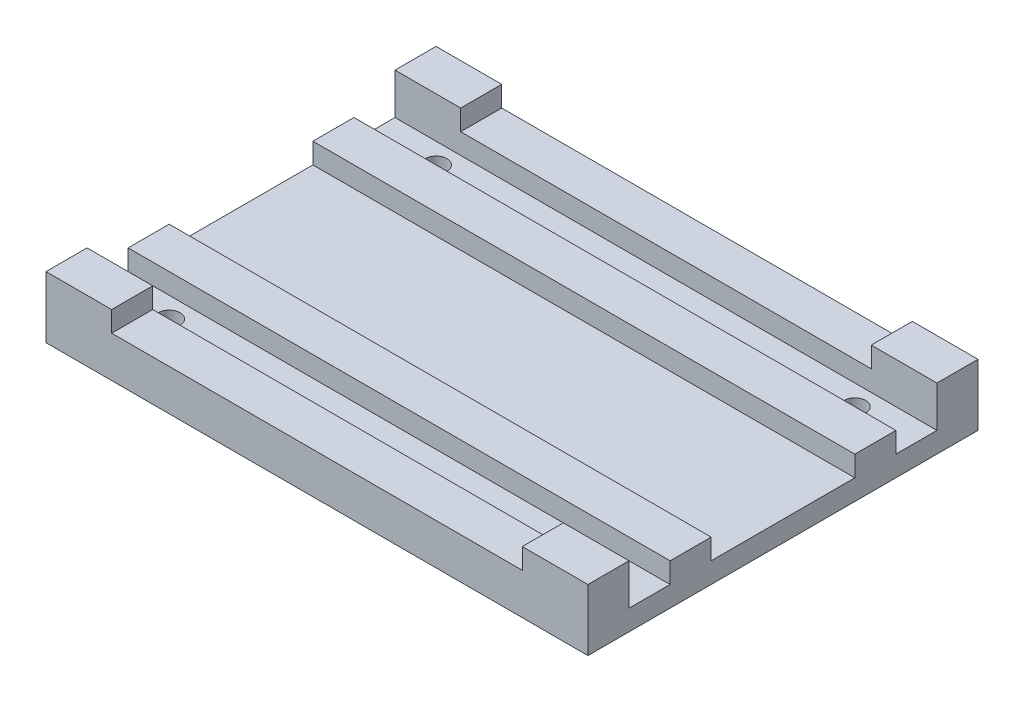
ISO-10303-21;
HEADER;
FILE_DESCRIPTION(('STEP AP214'),'2;1');
FILE_NAME('part.step','',(''),(''),'','','');
FILE_SCHEMA(('AUTOMOTIVE_DESIGN { 1 0 10303 214 1 1 1 1 }'));
ENDSEC;
DATA;
#1=APPLICATION_CONTEXT('core data for automotive mechanical design processes');
#2=APPLICATION_PROTOCOL_DEFINITION('international standard','automotive_design',2000,#1);
#3=PRODUCT_CONTEXT('',#1,'mechanical');
#4=PRODUCT('Part','Part','',(#3));
#5=PRODUCT_RELATED_PRODUCT_CATEGORY('part','',(#4));
#6=PRODUCT_DEFINITION_FORMATION('','',#4);
#7=PRODUCT_DEFINITION_CONTEXT('part definition',#1,'design');
#8=PRODUCT_DEFINITION('design','',#6,#7);
#9=PRODUCT_DEFINITION_SHAPE('','',#8);
#10=(LENGTH_UNIT() NAMED_UNIT(*) SI_UNIT(.MILLI.,.METRE.));
#11=(NAMED_UNIT(*) PLANE_ANGLE_UNIT() SI_UNIT($,.RADIAN.));
#12=(NAMED_UNIT(*) SI_UNIT($,.STERADIAN.) SOLID_ANGLE_UNIT());
#13=UNCERTAINTY_MEASURE_WITH_UNIT(LENGTH_MEASURE(1.E-05),#10,'distance_accuracy_value','');
#14=(GEOMETRIC_REPRESENTATION_CONTEXT(3) GLOBAL_UNCERTAINTY_ASSIGNED_CONTEXT((#13)) GLOBAL_UNIT_ASSIGNED_CONTEXT((#10,
#11,#12)) REPRESENTATION_CONTEXT('',''));
#15=CARTESIAN_POINT('',(0.,0.,0.));
#16=DIRECTION('',(0.,0.,1.));
#17=DIRECTION('',(1.,0.,0.));
#18=AXIS2_PLACEMENT_3D('',#15,#16,#17);
#19=CARTESIAN_POINT('',(-66.,5.,47.5));
#20=DIRECTION('',(1.,0.,0.));
#21=DIRECTION('',(0.,0.,-1.));
#22=AXIS2_PLACEMENT_3D('',#19,#20,#21);
#23=PLANE('',#22);
#24=DIRECTION('',(0.,0.,-1.));
#25=VECTOR('',#24,1.);
#26=CARTESIAN_POINT('',(-66.,10.,0.));
#27=LINE('',#26,#25);
#28=CARTESIAN_POINT('',(-66.,10.,-17.5));
#29=VERTEX_POINT('',#28);
#30=CARTESIAN_POINT('',(-66.,10.,-27.5));
#31=VERTEX_POINT('',#30);
#32=EDGE_CURVE('E408',#29,#31,#27,.T.);
#33=ORIENTED_EDGE('',*,*,#32,.T.);
#34=DIRECTION('',(0.,-1.,0.));
#35=VECTOR('',#34,1.);
#36=CARTESIAN_POINT('',(-66.,15.,-27.5));
#37=LINE('',#36,#35);
#38=CARTESIAN_POINT('',(-66.,5.,-27.5));
#39=VERTEX_POINT('',#38);
#40=EDGE_CURVE('E319',#31,#39,#37,.T.);
#41=ORIENTED_EDGE('',*,*,#40,.T.);
#42=DIRECTION('',(0.,0.,1.));
#43=VECTOR('',#42,1.);
#44=CARTESIAN_POINT('',(-66.,5.,47.5));
#45=LINE('',#44,#43);
#46=CARTESIAN_POINT('',(-66.,5.,-37.5));
#47=VERTEX_POINT('',#46);
#48=EDGE_CURVE('E262',#47,#39,#45,.T.);
#49=ORIENTED_EDGE('',*,*,#48,.F.);
#50=DIRECTION('',(0.,-1.,0.));
#51=VECTOR('',#50,1.);
#52=CARTESIAN_POINT('',(-66.,15.,-37.5));
#53=LINE('',#52,#51);
#54=CARTESIAN_POINT('',(-66.,15.,-37.5));
#55=VERTEX_POINT('',#54);
#56=EDGE_CURVE('E242',#55,#47,#53,.T.);
#57=ORIENTED_EDGE('',*,*,#56,.F.);
#58=DIRECTION('',(0.,0.,1.));
#59=VECTOR('',#58,1.);
#60=CARTESIAN_POINT('',(-66.,15.,-37.5));
#61=LINE('',#60,#59);
#62=CARTESIAN_POINT('',(-66.,15.,-47.5));
#63=VERTEX_POINT('',#62);
#64=EDGE_CURVE('E241',#63,#55,#61,.T.);
#65=ORIENTED_EDGE('',*,*,#64,.F.);
#66=DIRECTION('',(0.,-1.,0.));
#67=VECTOR('',#66,1.);
#68=CARTESIAN_POINT('',(-66.,5.,-47.5));
#69=LINE('',#68,#67);
#70=CARTESIAN_POINT('',(-66.,0.,-47.5));
#71=VERTEX_POINT('',#70);
#72=EDGE_CURVE('E287',#63,#71,#69,.T.);
#73=ORIENTED_EDGE('',*,*,#72,.T.);
#74=DIRECTION('',(0.,0.,1.));
#75=VECTOR('',#74,1.);
#76=CARTESIAN_POINT('',(-66.,0.,47.5));
#77=LINE('',#76,#75);
#78=CARTESIAN_POINT('',(-66.,0.,47.5));
#79=VERTEX_POINT('',#78);
#80=EDGE_CURVE('E346',#71,#79,#77,.T.);
#81=ORIENTED_EDGE('',*,*,#80,.T.);
#82=DIRECTION('',(0.,-1.,0.));
#83=VECTOR('',#82,1.);
#84=CARTESIAN_POINT('',(-66.,5.,47.5));
#85=LINE('',#84,#83);
#86=CARTESIAN_POINT('',(-66.,15.,47.5));
#87=VERTEX_POINT('',#86);
#88=EDGE_CURVE('E290',#87,#79,#85,.T.);
#89=ORIENTED_EDGE('',*,*,#88,.F.);
#90=DIRECTION('',(0.,0.,1.));
#91=VECTOR('',#90,1.);
#92=CARTESIAN_POINT('',(-66.,15.,37.5));
#93=LINE('',#92,#91);
#94=CARTESIAN_POINT('',(-66.,15.,37.5));
#95=VERTEX_POINT('',#94);
#96=EDGE_CURVE('E375',#95,#87,#93,.T.);
#97=ORIENTED_EDGE('',*,*,#96,.F.);
#98=DIRECTION('',(0.,-1.,0.));
#99=VECTOR('',#98,1.);
#100=CARTESIAN_POINT('',(-66.,15.,37.5));
#101=LINE('',#100,#99);
#102=CARTESIAN_POINT('',(-66.,5.,37.5));
#103=VERTEX_POINT('',#102);
#104=EDGE_CURVE('E399',#95,#103,#101,.T.);
#105=ORIENTED_EDGE('',*,*,#104,.T.);
#106=CARTESIAN_POINT('',(-66.,5.,27.5));
#107=VERTEX_POINT('',#106);
#108=EDGE_CURVE('E282',#107,#103,#45,.T.);
#109=ORIENTED_EDGE('',*,*,#108,.F.);
#110=DIRECTION('',(0.,-1.,0.));
#111=VECTOR('',#110,1.);
#112=CARTESIAN_POINT('',(-66.,15.,27.5));
#113=LINE('',#112,#111);
#114=CARTESIAN_POINT('',(-66.,10.,27.5));
#115=VERTEX_POINT('',#114);
#116=EDGE_CURVE('E403',#115,#107,#113,.T.);
#117=ORIENTED_EDGE('',*,*,#116,.F.);
#118=DIRECTION('',(0.,0.,-1.));
#119=VECTOR('',#118,1.);
#120=CARTESIAN_POINT('',(-66.,10.,0.));
#121=LINE('',#120,#119);
#122=CARTESIAN_POINT('',(-66.,10.,17.5));
#123=VERTEX_POINT('',#122);
#124=EDGE_CURVE('E204',#115,#123,#121,.T.);
#125=ORIENTED_EDGE('',*,*,#124,.T.);
#126=DIRECTION('',(0.,-1.,0.));
#127=VECTOR('',#126,1.);
#128=CARTESIAN_POINT('',(-66.,15.,17.5));
#129=LINE('',#128,#127);
#130=CARTESIAN_POINT('',(-66.,5.,17.5));
#131=VERTEX_POINT('',#130);
#132=EDGE_CURVE('E227',#123,#131,#129,.T.);
#133=ORIENTED_EDGE('',*,*,#132,.T.);
#134=CARTESIAN_POINT('',(-66.,5.,-17.5));
#135=VERTEX_POINT('',#134);
#136=EDGE_CURVE('E267',#135,#131,#45,.T.);
#137=ORIENTED_EDGE('',*,*,#136,.F.);
#138=DIRECTION('',(0.,-1.,0.));
#139=VECTOR('',#138,1.);
#140=CARTESIAN_POINT('',(-66.,15.,-17.5));
#141=LINE('',#140,#139);
#142=EDGE_CURVE('E295',#29,#135,#141,.T.);
#143=ORIENTED_EDGE('',*,*,#142,.F.);
#144=EDGE_LOOP('',(#33,#41,#49,#57,#65,#73,#81,#89,#97,#105,#109,#117,#125,#133,#137,#143));
#145=FACE_BOUND('',#144,.T.);
#146=ADVANCED_FACE('F34',(#145),#23,.F.);
#147=CARTESIAN_POINT('',(-66.,5.,47.5));
#148=DIRECTION('',(0.,0.,-1.));
#149=DIRECTION('',(-1.,0.,0.));
#150=AXIS2_PLACEMENT_3D('',#147,#148,#149);
#151=PLANE('',#150);
#152=DIRECTION('',(0.,-1.,0.));
#153=VECTOR('',#152,1.);
#154=CARTESIAN_POINT('',(-50.,5.,47.5));
#155=LINE('',#154,#153);
#156=CARTESIAN_POINT('',(-50.,15.,47.5));
#157=VERTEX_POINT('',#156);
#158=CARTESIAN_POINT('',(-50.,10.,47.5));
#159=VERTEX_POINT('',#158);
#160=EDGE_CURVE('E427',#157,#159,#155,.T.);
#161=ORIENTED_EDGE('',*,*,#160,.F.);
#162=DIRECTION('',(1.,0.,0.));
#163=VECTOR('',#162,1.);
#164=CARTESIAN_POINT('',(-66.,15.,47.5));
#165=LINE('',#164,#163);
#166=EDGE_CURVE('E371',#87,#157,#165,.T.);
#167=ORIENTED_EDGE('',*,*,#166,.F.);
#168=ORIENTED_EDGE('',*,*,#88,.T.);
#169=DIRECTION('',(1.,0.,0.));
#170=VECTOR('',#169,1.);
#171=CARTESIAN_POINT('',(-66.,0.,47.5));
#172=LINE('',#171,#170);
#173=CARTESIAN_POINT('',(66.,0.,47.5));
#174=VERTEX_POINT('',#173);
#175=EDGE_CURVE('E350',#79,#174,#172,.T.);
#176=ORIENTED_EDGE('',*,*,#175,.T.);
#177=DIRECTION('',(0.,-1.,0.));
#178=VECTOR('',#177,1.);
#179=CARTESIAN_POINT('',(66.,5.,47.5));
#180=LINE('',#179,#178);
#181=CARTESIAN_POINT('',(66.,15.,47.5));
#182=VERTEX_POINT('',#181);
#183=EDGE_CURVE('E362',#182,#174,#180,.T.);
#184=ORIENTED_EDGE('',*,*,#183,.F.);
#185=CARTESIAN_POINT('',(50.,15.,47.5));
#186=VERTEX_POINT('',#185);
#187=EDGE_CURVE('E382',#186,#182,#165,.T.);
#188=ORIENTED_EDGE('',*,*,#187,.F.);
#189=DIRECTION('',(0.,-1.,0.));
#190=VECTOR('',#189,1.);
#191=CARTESIAN_POINT('',(50.,5.,47.5));
#192=LINE('',#191,#190);
#193=CARTESIAN_POINT('',(50.,10.,47.5));
#194=VERTEX_POINT('',#193);
#195=EDGE_CURVE('E59',#186,#194,#192,.T.);
#196=ORIENTED_EDGE('',*,*,#195,.T.);
#197=DIRECTION('',(1.,0.,0.));
#198=VECTOR('',#197,1.);
#199=CARTESIAN_POINT('',(-66.,10.,47.5));
#200=LINE('',#199,#198);
#201=EDGE_CURVE('E433',#159,#194,#200,.T.);
#202=ORIENTED_EDGE('',*,*,#201,.F.);
#203=EDGE_LOOP('',(#161,#167,#168,#176,#184,#188,#196,#202));
#204=FACE_BOUND('',#203,.T.);
#205=ADVANCED_FACE('F368',(#204),#151,.F.);
#206=CARTESIAN_POINT('',(66.,5.,47.5));
#207=DIRECTION('',(-1.,0.,0.));
#208=DIRECTION('',(0.,0.,1.));
#209=AXIS2_PLACEMENT_3D('',#206,#207,#208);
#210=PLANE('',#209);
#211=DIRECTION('',(0.,0.,-1.));
#212=VECTOR('',#211,1.);
#213=CARTESIAN_POINT('',(66.,10.,0.));
#214=LINE('',#213,#212);
#215=CARTESIAN_POINT('',(66.,10.,27.5));
#216=VERTEX_POINT('',#215);
#217=CARTESIAN_POINT('',(66.,10.,17.5));
#218=VERTEX_POINT('',#217);
#219=EDGE_CURVE('E201',#216,#218,#214,.T.);
#220=ORIENTED_EDGE('',*,*,#219,.F.);
#221=DIRECTION('',(0.,-1.,0.));
#222=VECTOR('',#221,1.);
#223=CARTESIAN_POINT('',(66.,15.,27.5));
#224=LINE('',#223,#222);
#225=CARTESIAN_POINT('',(66.,5.,27.5));
#226=VERTEX_POINT('',#225);
#227=EDGE_CURVE('E212',#216,#226,#224,.T.);
#228=ORIENTED_EDGE('',*,*,#227,.T.);
#229=DIRECTION('',(0.,0.,-1.));
#230=VECTOR('',#229,1.);
#231=CARTESIAN_POINT('',(66.,5.,47.5));
#232=LINE('',#231,#230);
#233=CARTESIAN_POINT('',(66.,5.,37.5));
#234=VERTEX_POINT('',#233);
#235=EDGE_CURVE('E285',#234,#226,#232,.T.);
#236=ORIENTED_EDGE('',*,*,#235,.F.);
#237=DIRECTION('',(0.,-1.,0.));
#238=VECTOR('',#237,1.);
#239=CARTESIAN_POINT('',(66.,15.,37.5));
#240=LINE('',#239,#238);
#241=CARTESIAN_POINT('',(66.,15.,37.5));
#242=VERTEX_POINT('',#241);
#243=EDGE_CURVE('E392',#242,#234,#240,.T.);
#244=ORIENTED_EDGE('',*,*,#243,.F.);
#245=DIRECTION('',(0.,0.,-1.));
#246=VECTOR('',#245,1.);
#247=CARTESIAN_POINT('',(66.,15.,37.5));
#248=LINE('',#247,#246);
#249=EDGE_CURVE('E390',#182,#242,#248,.T.);
#250=ORIENTED_EDGE('',*,*,#249,.F.);
#251=ORIENTED_EDGE('',*,*,#183,.T.);
#252=DIRECTION('',(0.,0.,-1.));
#253=VECTOR('',#252,1.);
#254=CARTESIAN_POINT('',(66.,0.,47.5));
#255=LINE('',#254,#253);
#256=CARTESIAN_POINT('',(66.,0.,-47.5));
#257=VERTEX_POINT('',#256);
#258=EDGE_CURVE('E353',#174,#257,#255,.T.);
#259=ORIENTED_EDGE('',*,*,#258,.T.);
#260=DIRECTION('',(0.,-1.,0.));
#261=VECTOR('',#260,1.);
#262=CARTESIAN_POINT('',(66.,5.,-47.5));
#263=LINE('',#262,#261);
#264=CARTESIAN_POINT('',(66.,15.,-47.5));
#265=VERTEX_POINT('',#264);
#266=EDGE_CURVE('E359',#265,#257,#263,.T.);
#267=ORIENTED_EDGE('',*,*,#266,.F.);
#268=DIRECTION('',(0.,0.,-1.));
#269=VECTOR('',#268,1.);
#270=CARTESIAN_POINT('',(66.,15.,-37.5));
#271=LINE('',#270,#269);
#272=CARTESIAN_POINT('',(66.,15.,-37.5));
#273=VERTEX_POINT('',#272);
#274=EDGE_CURVE('E234',#273,#265,#271,.T.);
#275=ORIENTED_EDGE('',*,*,#274,.F.);
#276=DIRECTION('',(0.,-1.,0.));
#277=VECTOR('',#276,1.);
#278=CARTESIAN_POINT('',(66.,15.,-37.5));
#279=LINE('',#278,#277);
#280=CARTESIAN_POINT('',(66.,5.,-37.5));
#281=VERTEX_POINT('',#280);
#282=EDGE_CURVE('E246',#273,#281,#279,.T.);
#283=ORIENTED_EDGE('',*,*,#282,.T.);
#284=CARTESIAN_POINT('',(66.,5.,-27.5));
#285=VERTEX_POINT('',#284);
#286=EDGE_CURVE('E266',#285,#281,#232,.T.);
#287=ORIENTED_EDGE('',*,*,#286,.F.);
#288=DIRECTION('',(0.,-1.,0.));
#289=VECTOR('',#288,1.);
#290=CARTESIAN_POINT('',(66.,15.,-27.5));
#291=LINE('',#290,#289);
#292=CARTESIAN_POINT('',(66.,10.,-27.5));
#293=VERTEX_POINT('',#292);
#294=EDGE_CURVE('E37',#293,#285,#291,.T.);
#295=ORIENTED_EDGE('',*,*,#294,.F.);
#296=DIRECTION('',(0.,0.,-1.));
#297=VECTOR('',#296,1.);
#298=CARTESIAN_POINT('',(66.,10.,0.));
#299=LINE('',#298,#297);
#300=CARTESIAN_POINT('',(66.,10.,-17.5));
#301=VERTEX_POINT('',#300);
#302=EDGE_CURVE('E466',#301,#293,#299,.T.);
#303=ORIENTED_EDGE('',*,*,#302,.F.);
#304=DIRECTION('',(0.,-1.,0.));
#305=VECTOR('',#304,1.);
#306=CARTESIAN_POINT('',(66.,15.,-17.5));
#307=LINE('',#306,#305);
#308=CARTESIAN_POINT('',(66.,5.,-17.5));
#309=VERTEX_POINT('',#308);
#310=EDGE_CURVE('E292',#301,#309,#307,.T.);
#311=ORIENTED_EDGE('',*,*,#310,.T.);
#312=CARTESIAN_POINT('',(66.,5.,17.5));
#313=VERTEX_POINT('',#312);
#314=EDGE_CURVE('E268',#313,#309,#232,.T.);
#315=ORIENTED_EDGE('',*,*,#314,.F.);
#316=DIRECTION('',(0.,-1.,0.));
#317=VECTOR('',#316,1.);
#318=CARTESIAN_POINT('',(66.,15.,17.5));
#319=LINE('',#318,#317);
#320=EDGE_CURVE('E215',#218,#313,#319,.T.);
#321=ORIENTED_EDGE('',*,*,#320,.F.);
#322=EDGE_LOOP('',(#220,#228,#236,#244,#250,#251,#259,#267,#275,#283,#287,#295,#303,#311,#315,#321));
#323=FACE_BOUND('',#322,.T.);
#324=ADVANCED_FACE('F211',(#323),#210,.F.);
#325=CARTESIAN_POINT('',(-66.,5.,-47.5));
#326=DIRECTION('',(0.,0.,1.));
#327=DIRECTION('',(1.,0.,0.));
#328=AXIS2_PLACEMENT_3D('',#325,#326,#327);
#329=PLANE('',#328);
#330=DIRECTION('',(0.,1.,0.));
#331=VECTOR('',#330,1.);
#332=CARTESIAN_POINT('',(-50.,5.,-47.5));
#333=LINE('',#332,#331);
#334=CARTESIAN_POINT('',(-50.,10.,-47.5));
#335=VERTEX_POINT('',#334);
#336=CARTESIAN_POINT('',(-50.,15.,-47.5));
#337=VERTEX_POINT('',#336);
#338=EDGE_CURVE('E396',#335,#337,#333,.T.);
#339=ORIENTED_EDGE('',*,*,#338,.F.);
#340=DIRECTION('',(-1.,0.,0.));
#341=VECTOR('',#340,1.);
#342=CARTESIAN_POINT('',(-66.,10.,-47.5));
#343=LINE('',#342,#341);
#344=CARTESIAN_POINT('',(50.,10.,-47.5));
#345=VERTEX_POINT('',#344);
#346=EDGE_CURVE('E431',#345,#335,#343,.T.);
#347=ORIENTED_EDGE('',*,*,#346,.F.);
#348=DIRECTION('',(0.,1.,0.));
#349=VECTOR('',#348,1.);
#350=CARTESIAN_POINT('',(50.,5.,-47.5));
#351=LINE('',#350,#349);
#352=CARTESIAN_POINT('',(50.,15.,-47.5));
#353=VERTEX_POINT('',#352);
#354=EDGE_CURVE('E436',#345,#353,#351,.T.);
#355=ORIENTED_EDGE('',*,*,#354,.T.);
#356=DIRECTION('',(-1.,0.,0.));
#357=VECTOR('',#356,1.);
#358=CARTESIAN_POINT('',(-66.,15.,-47.5));
#359=LINE('',#358,#357);
#360=EDGE_CURVE('E238',#265,#353,#359,.T.);
#361=ORIENTED_EDGE('',*,*,#360,.F.);
#362=ORIENTED_EDGE('',*,*,#266,.T.);
#363=DIRECTION('',(-1.,0.,0.));
#364=VECTOR('',#363,1.);
#365=CARTESIAN_POINT('',(-66.,0.,-47.5));
#366=LINE('',#365,#364);
#367=EDGE_CURVE('E284',#257,#71,#366,.T.);
#368=ORIENTED_EDGE('',*,*,#367,.T.);
#369=ORIENTED_EDGE('',*,*,#72,.F.);
#370=EDGE_CURVE('E237',#337,#63,#359,.T.);
#371=ORIENTED_EDGE('',*,*,#370,.F.);
#372=EDGE_LOOP('',(#339,#347,#355,#361,#362,#368,#369,#371));
#373=FACE_BOUND('',#372,.T.);
#374=ADVANCED_FACE('F454',(#373),#329,.F.);
#375=CARTESIAN_POINT('',(-66.,15.,-27.5));
#376=DIRECTION('',(0.,0.,1.));
#377=DIRECTION('',(1.,0.,0.));
#378=AXIS2_PLACEMENT_3D('',#375,#376,#377);
#379=PLANE('',#378);
#380=DIRECTION('',(1.,0.,0.));
#381=VECTOR('',#380,1.);
#382=CARTESIAN_POINT('',(0.,10.,-27.5));
#383=LINE('',#382,#381);
#384=EDGE_CURVE('E412',#31,#293,#383,.T.);
#385=ORIENTED_EDGE('',*,*,#384,.T.);
#386=ORIENTED_EDGE('',*,*,#294,.T.);
#387=DIRECTION('',(-1.,0.,0.));
#388=VECTOR('',#387,1.);
#389=CARTESIAN_POINT('',(-66.,5.,-27.5));
#390=LINE('',#389,#388);
#391=EDGE_CURVE('E249',#285,#39,#390,.T.);
#392=ORIENTED_EDGE('',*,*,#391,.T.);
#393=ORIENTED_EDGE('',*,*,#40,.F.);
#394=EDGE_LOOP('',(#385,#386,#392,#393));
#395=FACE_BOUND('',#394,.T.);
#396=ADVANCED_FACE('F483',(#395),#379,.F.);
#397=CARTESIAN_POINT('',(-66.,15.,-17.5));
#398=DIRECTION('',(0.,0.,-1.));
#399=DIRECTION('',(-1.,0.,0.));
#400=AXIS2_PLACEMENT_3D('',#397,#398,#399);
#401=PLANE('',#400);
#402=DIRECTION('',(-1.,0.,0.));
#403=VECTOR('',#402,1.);
#404=CARTESIAN_POINT('',(0.,10.,-17.5));
#405=LINE('',#404,#403);
#406=EDGE_CURVE('E216',#301,#29,#405,.T.);
#407=ORIENTED_EDGE('',*,*,#406,.T.);
#408=ORIENTED_EDGE('',*,*,#142,.T.);
#409=DIRECTION('',(1.,0.,0.));
#410=VECTOR('',#409,1.);
#411=CARTESIAN_POINT('',(-66.,5.,-17.5));
#412=LINE('',#411,#410);
#413=EDGE_CURVE('E257',#135,#309,#412,.T.);
#414=ORIENTED_EDGE('',*,*,#413,.T.);
#415=ORIENTED_EDGE('',*,*,#310,.F.);
#416=EDGE_LOOP('',(#407,#408,#414,#415));
#417=FACE_BOUND('',#416,.T.);
#418=ADVANCED_FACE('F314',(#417),#401,.F.);
#419=CARTESIAN_POINT('',(-66.,15.,-37.5));
#420=DIRECTION('',(0.,0.,-1.));
#421=DIRECTION('',(-1.,0.,0.));
#422=AXIS2_PLACEMENT_3D('',#419,#420,#421);
#423=PLANE('',#422);
#424=DIRECTION('',(0.,-1.,0.));
#425=VECTOR('',#424,1.);
#426=CARTESIAN_POINT('',(-50.,15.,-37.5));
#427=LINE('',#426,#425);
#428=CARTESIAN_POINT('',(-50.,15.,-37.5));
#429=VERTEX_POINT('',#428);
#430=CARTESIAN_POINT('',(-50.,10.,-37.5));
#431=VERTEX_POINT('',#430);
#432=EDGE_CURVE('E439',#429,#431,#427,.T.);
#433=ORIENTED_EDGE('',*,*,#432,.F.);
#434=DIRECTION('',(1.,0.,0.));
#435=VECTOR('',#434,1.);
#436=CARTESIAN_POINT('',(-66.,15.,-37.5));
#437=LINE('',#436,#435);
#438=EDGE_CURVE('E231',#55,#429,#437,.T.);
#439=ORIENTED_EDGE('',*,*,#438,.F.);
#440=ORIENTED_EDGE('',*,*,#56,.T.);
#441=DIRECTION('',(1.,0.,0.));
#442=VECTOR('',#441,1.);
#443=CARTESIAN_POINT('',(-66.,5.,-37.5));
#444=LINE('',#443,#442);
#445=EDGE_CURVE('E222',#47,#281,#444,.T.);
#446=ORIENTED_EDGE('',*,*,#445,.T.);
#447=ORIENTED_EDGE('',*,*,#282,.F.);
#448=CARTESIAN_POINT('',(50.,15.,-37.5));
#449=VERTEX_POINT('',#448);
#450=EDGE_CURVE('E225',#449,#273,#437,.T.);
#451=ORIENTED_EDGE('',*,*,#450,.F.);
#452=DIRECTION('',(0.,-1.,0.));
#453=VECTOR('',#452,1.);
#454=CARTESIAN_POINT('',(50.,15.,-37.5));
#455=LINE('',#454,#453);
#456=CARTESIAN_POINT('',(50.,10.,-37.5));
#457=VERTEX_POINT('',#456);
#458=EDGE_CURVE('E51',#449,#457,#455,.T.);
#459=ORIENTED_EDGE('',*,*,#458,.T.);
#460=DIRECTION('',(1.,0.,0.));
#461=VECTOR('',#460,1.);
#462=CARTESIAN_POINT('',(-66.,10.,-37.5));
#463=LINE('',#462,#461);
#464=EDGE_CURVE('E429',#431,#457,#463,.T.);
#465=ORIENTED_EDGE('',*,*,#464,.F.);
#466=EDGE_LOOP('',(#433,#439,#440,#446,#447,#451,#459,#465));
#467=FACE_BOUND('',#466,.T.);
#468=ADVANCED_FACE('F459',(#467),#423,.F.);
#469=CARTESIAN_POINT('',(0.,15.,0.));
#470=DIRECTION('',(0.,1.,0.));
#471=DIRECTION('',(0.,0.,1.));
#472=AXIS2_PLACEMENT_3D('',#469,#470,#471);
#473=PLANE('',#472);
#474=ORIENTED_EDGE('',*,*,#438,.T.);
#475=DIRECTION('',(0.,0.,-1.));
#476=VECTOR('',#475,1.);
#477=CARTESIAN_POINT('',(-50.,15.,0.));
#478=LINE('',#477,#476);
#479=EDGE_CURVE('E416',#429,#337,#478,.T.);
#480=ORIENTED_EDGE('',*,*,#479,.T.);
#481=ORIENTED_EDGE('',*,*,#370,.T.);
#482=ORIENTED_EDGE('',*,*,#64,.T.);
#483=EDGE_LOOP('',(#474,#480,#481,#482));
#484=FACE_BOUND('',#483,.T.);
#485=ADVANCED_FACE('F451',(#484),#473,.T.);
#486=CARTESIAN_POINT('',(-66.,15.,27.5));
#487=DIRECTION('',(0.,0.,-1.));
#488=DIRECTION('',(-1.,0.,0.));
#489=AXIS2_PLACEMENT_3D('',#486,#487,#488);
#490=PLANE('',#489);
#491=DIRECTION('',(-1.,0.,0.));
#492=VECTOR('',#491,1.);
#493=CARTESIAN_POINT('',(0.,10.,27.5));
#494=LINE('',#493,#492);
#495=EDGE_CURVE('E198',#216,#115,#494,.T.);
#496=ORIENTED_EDGE('',*,*,#495,.T.);
#497=ORIENTED_EDGE('',*,*,#116,.T.);
#498=DIRECTION('',(1.,0.,0.));
#499=VECTOR('',#498,1.);
#500=CARTESIAN_POINT('',(-66.,5.,27.5));
#501=LINE('',#500,#499);
#502=EDGE_CURVE('E221',#107,#226,#501,.T.);
#503=ORIENTED_EDGE('',*,*,#502,.T.);
#504=ORIENTED_EDGE('',*,*,#227,.F.);
#505=EDGE_LOOP('',(#496,#497,#503,#504));
#506=FACE_BOUND('',#505,.T.);
#507=ADVANCED_FACE('F219',(#506),#490,.F.);
#508=CARTESIAN_POINT('',(-66.,15.,17.5));
#509=DIRECTION('',(0.,0.,1.));
#510=DIRECTION('',(1.,0.,0.));
#511=AXIS2_PLACEMENT_3D('',#508,#509,#510);
#512=PLANE('',#511);
#513=DIRECTION('',(1.,0.,0.));
#514=VECTOR('',#513,1.);
#515=CARTESIAN_POINT('',(0.,10.,17.5));
#516=LINE('',#515,#514);
#517=EDGE_CURVE('E407',#123,#218,#516,.T.);
#518=ORIENTED_EDGE('',*,*,#517,.T.);
#519=ORIENTED_EDGE('',*,*,#320,.T.);
#520=DIRECTION('',(-1.,0.,0.));
#521=VECTOR('',#520,1.);
#522=CARTESIAN_POINT('',(-66.,5.,17.5));
#523=LINE('',#522,#521);
#524=EDGE_CURVE('E311',#313,#131,#523,.T.);
#525=ORIENTED_EDGE('',*,*,#524,.T.);
#526=ORIENTED_EDGE('',*,*,#132,.F.);
#527=EDGE_LOOP('',(#518,#519,#525,#526));
#528=FACE_BOUND('',#527,.T.);
#529=ADVANCED_FACE('F406',(#528),#512,.F.);
#530=CARTESIAN_POINT('',(-66.,15.,37.5));
#531=DIRECTION('',(0.,0.,1.));
#532=DIRECTION('',(1.,0.,0.));
#533=AXIS2_PLACEMENT_3D('',#530,#531,#532);
#534=PLANE('',#533);
#535=DIRECTION('',(0.,1.,0.));
#536=VECTOR('',#535,1.);
#537=CARTESIAN_POINT('',(-50.,15.,37.5));
#538=LINE('',#537,#536);
#539=CARTESIAN_POINT('',(-50.,10.,37.5));
#540=VERTEX_POINT('',#539);
#541=CARTESIAN_POINT('',(-50.,15.,37.5));
#542=VERTEX_POINT('',#541);
#543=EDGE_CURVE('E425',#540,#542,#538,.T.);
#544=ORIENTED_EDGE('',*,*,#543,.F.);
#545=DIRECTION('',(-1.,0.,0.));
#546=VECTOR('',#545,1.);
#547=CARTESIAN_POINT('',(-66.,10.,37.5));
#548=LINE('',#547,#546);
#549=CARTESIAN_POINT('',(50.,10.,37.5));
#550=VERTEX_POINT('',#549);
#551=EDGE_CURVE('E11',#550,#540,#548,.T.);
#552=ORIENTED_EDGE('',*,*,#551,.F.);
#553=DIRECTION('',(0.,1.,0.));
#554=VECTOR('',#553,1.);
#555=CARTESIAN_POINT('',(50.,15.,37.5));
#556=LINE('',#555,#554);
#557=CARTESIAN_POINT('',(50.,15.,37.5));
#558=VERTEX_POINT('',#557);
#559=EDGE_CURVE('E410',#550,#558,#556,.T.);
#560=ORIENTED_EDGE('',*,*,#559,.T.);
#561=DIRECTION('',(-1.,0.,0.));
#562=VECTOR('',#561,1.);
#563=CARTESIAN_POINT('',(-66.,15.,37.5));
#564=LINE('',#563,#562);
#565=EDGE_CURVE('E383',#242,#558,#564,.T.);
#566=ORIENTED_EDGE('',*,*,#565,.F.);
#567=ORIENTED_EDGE('',*,*,#243,.T.);
#568=DIRECTION('',(-1.,0.,0.));
#569=VECTOR('',#568,1.);
#570=CARTESIAN_POINT('',(-66.,5.,37.5));
#571=LINE('',#570,#569);
#572=EDGE_CURVE('E393',#234,#103,#571,.T.);
#573=ORIENTED_EDGE('',*,*,#572,.T.);
#574=ORIENTED_EDGE('',*,*,#104,.F.);
#575=EDGE_CURVE('E381',#542,#95,#564,.T.);
#576=ORIENTED_EDGE('',*,*,#575,.F.);
#577=EDGE_LOOP('',(#544,#552,#560,#566,#567,#573,#574,#576));
#578=FACE_BOUND('',#577,.T.);
#579=ADVANCED_FACE('F553',(#578),#534,.F.);
#580=CARTESIAN_POINT('',(0.,15.,0.));
#581=DIRECTION('',(0.,-1.,0.));
#582=DIRECTION('',(0.,0.,-1.));
#583=AXIS2_PLACEMENT_3D('',#580,#581,#582);
#584=PLANE('',#583);
#585=DIRECTION('',(0.,0.,1.));
#586=VECTOR('',#585,1.);
#587=CARTESIAN_POINT('',(-50.,15.,0.));
#588=LINE('',#587,#586);
#589=EDGE_CURVE('E43',#542,#157,#588,.T.);
#590=ORIENTED_EDGE('',*,*,#589,.F.);
#591=ORIENTED_EDGE('',*,*,#575,.T.);
#592=ORIENTED_EDGE('',*,*,#96,.T.);
#593=ORIENTED_EDGE('',*,*,#166,.T.);
#594=EDGE_LOOP('',(#590,#591,#592,#593));
#595=FACE_BOUND('',#594,.T.);
#596=ADVANCED_FACE('F379',(#595),#584,.F.);
#597=CARTESIAN_POINT('',(0.,5.,0.));
#598=DIRECTION('',(0.,-1.,0.));
#599=DIRECTION('',(0.,0.,-1.));
#600=AXIS2_PLACEMENT_3D('',#597,#598,#599);
#601=PLANE('',#600);
#602=CARTESIAN_POINT('',(-51.,5.,32.5));
#603=DIRECTION('',(0.,1.,0.));
#604=DIRECTION('',(0.,0.,1.));
#605=AXIS2_PLACEMENT_3D('',#602,#603,#604);
#606=CIRCLE('',#605,2.65);
#607=CARTESIAN_POINT('',(-51.,5.,35.15));
#608=VERTEX_POINT('',#607);
#609=EDGE_CURVE('E341',#608,#608,#606,.T.);
#610=ORIENTED_EDGE('',*,*,#609,.F.);
#611=EDGE_LOOP('',(#610));
#612=FACE_BOUND('',#611,.T.);
#613=CARTESIAN_POINT('',(51.,5.,32.5));
#614=DIRECTION('',(0.,1.,0.));
#615=DIRECTION('',(0.,0.,1.));
#616=AXIS2_PLACEMENT_3D('',#613,#614,#615);
#617=CIRCLE('',#616,2.65);
#618=CARTESIAN_POINT('',(51.,5.,35.15));
#619=VERTEX_POINT('',#618);
#620=EDGE_CURVE('E336',#619,#619,#617,.T.);
#621=ORIENTED_EDGE('',*,*,#620,.F.);
#622=EDGE_LOOP('',(#621));
#623=FACE_BOUND('',#622,.T.);
#624=ORIENTED_EDGE('',*,*,#572,.F.);
#625=ORIENTED_EDGE('',*,*,#235,.T.);
#626=ORIENTED_EDGE('',*,*,#502,.F.);
#627=ORIENTED_EDGE('',*,*,#108,.T.);
#628=EDGE_LOOP('',(#624,#625,#626,#627));
#629=FACE_BOUND('',#628,.T.);
#630=ADVANCED_FACE('F525',(#612,#623,#629),#601,.F.);
#631=ORIENTED_EDGE('',*,*,#524,.F.);
#632=ORIENTED_EDGE('',*,*,#314,.T.);
#633=ORIENTED_EDGE('',*,*,#413,.F.);
#634=ORIENTED_EDGE('',*,*,#136,.T.);
#635=EDGE_LOOP('',(#631,#632,#633,#634));
#636=FACE_BOUND('',#635,.T.);
#637=ADVANCED_FACE('F307',(#636),#601,.F.);
#638=CARTESIAN_POINT('',(-51.,5.,-32.5));
#639=DIRECTION('',(0.,1.,0.));
#640=DIRECTION('',(0.,0.,1.));
#641=AXIS2_PLACEMENT_3D('',#638,#639,#640);
#642=CIRCLE('',#641,2.65);
#643=CARTESIAN_POINT('',(-51.,5.,-29.85));
#644=VERTEX_POINT('',#643);
#645=EDGE_CURVE('E320',#644,#644,#642,.T.);
#646=ORIENTED_EDGE('',*,*,#645,.F.);
#647=EDGE_LOOP('',(#646));
#648=FACE_BOUND('',#647,.T.);
#649=CARTESIAN_POINT('',(51.,5.,-32.5));
#650=DIRECTION('',(0.,1.,0.));
#651=DIRECTION('',(0.,0.,1.));
#652=AXIS2_PLACEMENT_3D('',#649,#650,#651);
#653=CIRCLE('',#652,2.65);
#654=CARTESIAN_POINT('',(51.,5.,-29.85));
#655=VERTEX_POINT('',#654);
#656=EDGE_CURVE('E328',#655,#655,#653,.T.);
#657=ORIENTED_EDGE('',*,*,#656,.F.);
#658=EDGE_LOOP('',(#657));
#659=FACE_BOUND('',#658,.T.);
#660=ORIENTED_EDGE('',*,*,#445,.F.);
#661=ORIENTED_EDGE('',*,*,#48,.T.);
#662=ORIENTED_EDGE('',*,*,#391,.F.);
#663=ORIENTED_EDGE('',*,*,#286,.T.);
#664=EDGE_LOOP('',(#660,#661,#662,#663));
#665=FACE_BOUND('',#664,.T.);
#666=ADVANCED_FACE('F484',(#648,#659,#665),#601,.F.);
#667=CARTESIAN_POINT('',(0.,0.,0.));
#668=DIRECTION('',(0.,-1.,0.));
#669=DIRECTION('',(0.,0.,-1.));
#670=AXIS2_PLACEMENT_3D('',#667,#668,#669);
#671=PLANE('',#670);
#672=CARTESIAN_POINT('',(-51.,0.,-32.5));
#673=DIRECTION('',(0.,1.,0.));
#674=DIRECTION('',(0.,0.,1.));
#675=AXIS2_PLACEMENT_3D('',#672,#673,#674);
#676=CIRCLE('',#675,2.65);
#677=CARTESIAN_POINT('',(-51.,0.,-29.85));
#678=VERTEX_POINT('',#677);
#679=EDGE_CURVE('E324',#678,#678,#676,.T.);
#680=ORIENTED_EDGE('',*,*,#679,.T.);
#681=EDGE_LOOP('',(#680));
#682=FACE_BOUND('',#681,.T.);
#683=CARTESIAN_POINT('',(51.,0.,-32.5));
#684=DIRECTION('',(0.,1.,0.));
#685=DIRECTION('',(0.,0.,1.));
#686=AXIS2_PLACEMENT_3D('',#683,#684,#685);
#687=CIRCLE('',#686,2.65);
#688=CARTESIAN_POINT('',(51.,0.,-29.85));
#689=VERTEX_POINT('',#688);
#690=EDGE_CURVE('E333',#689,#689,#687,.T.);
#691=ORIENTED_EDGE('',*,*,#690,.T.);
#692=EDGE_LOOP('',(#691));
#693=FACE_BOUND('',#692,.T.);
#694=CARTESIAN_POINT('',(51.,0.,32.5));
#695=DIRECTION('',(0.,1.,0.));
#696=DIRECTION('',(0.,0.,1.));
#697=AXIS2_PLACEMENT_3D('',#694,#695,#696);
#698=CIRCLE('',#697,2.65);
#699=CARTESIAN_POINT('',(51.,0.,35.15));
#700=VERTEX_POINT('',#699);
#701=EDGE_CURVE('E339',#700,#700,#698,.T.);
#702=ORIENTED_EDGE('',*,*,#701,.T.);
#703=EDGE_LOOP('',(#702));
#704=FACE_BOUND('',#703,.T.);
#705=CARTESIAN_POINT('',(-51.,0.,32.5));
#706=DIRECTION('',(0.,1.,0.));
#707=DIRECTION('',(0.,0.,1.));
#708=AXIS2_PLACEMENT_3D('',#705,#706,#707);
#709=CIRCLE('',#708,2.65);
#710=CARTESIAN_POINT('',(-51.,0.,35.15));
#711=VERTEX_POINT('',#710);
#712=EDGE_CURVE('E273',#711,#711,#709,.T.);
#713=ORIENTED_EDGE('',*,*,#712,.T.);
#714=EDGE_LOOP('',(#713));
#715=FACE_BOUND('',#714,.T.);
#716=ORIENTED_EDGE('',*,*,#80,.F.);
#717=ORIENTED_EDGE('',*,*,#367,.F.);
#718=ORIENTED_EDGE('',*,*,#258,.F.);
#719=ORIENTED_EDGE('',*,*,#175,.F.);
#720=EDGE_LOOP('',(#716,#717,#718,#719));
#721=FACE_BOUND('',#720,.T.);
#722=ADVANCED_FACE('F517',(#682,#693,#704,#715,#721),#671,.T.);
#723=CARTESIAN_POINT('',(-51.,5.,32.5));
#724=DIRECTION('',(0.,1.,0.));
#725=DIRECTION('',(0.,0.,1.));
#726=AXIS2_PLACEMENT_3D('',#723,#724,#725);
#727=CYLINDRICAL_SURFACE('',#726,2.65);
#728=ORIENTED_EDGE('',*,*,#712,.F.);
#729=EDGE_LOOP('',(#728));
#730=FACE_BOUND('',#729,.T.);
#731=ORIENTED_EDGE('',*,*,#609,.T.);
#732=EDGE_LOOP('',(#731));
#733=FACE_BOUND('',#732,.T.);
#734=ADVANCED_FACE('F520',(#730,#733),#727,.F.);
#735=CARTESIAN_POINT('',(51.,5.,32.5));
#736=DIRECTION('',(0.,1.,0.));
#737=DIRECTION('',(0.,0.,1.));
#738=AXIS2_PLACEMENT_3D('',#735,#736,#737);
#739=CYLINDRICAL_SURFACE('',#738,2.65);
#740=ORIENTED_EDGE('',*,*,#701,.F.);
#741=EDGE_LOOP('',(#740));
#742=FACE_BOUND('',#741,.T.);
#743=ORIENTED_EDGE('',*,*,#620,.T.);
#744=EDGE_LOOP('',(#743));
#745=FACE_BOUND('',#744,.T.);
#746=ADVANCED_FACE('F528',(#742,#745),#739,.F.);
#747=CARTESIAN_POINT('',(51.,5.,-32.5));
#748=DIRECTION('',(0.,1.,0.));
#749=DIRECTION('',(0.,0.,1.));
#750=AXIS2_PLACEMENT_3D('',#747,#748,#749);
#751=CYLINDRICAL_SURFACE('',#750,2.65);
#752=ORIENTED_EDGE('',*,*,#690,.F.);
#753=EDGE_LOOP('',(#752));
#754=FACE_BOUND('',#753,.T.);
#755=ORIENTED_EDGE('',*,*,#656,.T.);
#756=EDGE_LOOP('',(#755));
#757=FACE_BOUND('',#756,.T.);
#758=ADVANCED_FACE('F532',(#754,#757),#751,.F.);
#759=CARTESIAN_POINT('',(-51.,5.,-32.5));
#760=DIRECTION('',(0.,1.,0.));
#761=DIRECTION('',(0.,0.,1.));
#762=AXIS2_PLACEMENT_3D('',#759,#760,#761);
#763=CYLINDRICAL_SURFACE('',#762,2.65);
#764=ORIENTED_EDGE('',*,*,#679,.F.);
#765=EDGE_LOOP('',(#764));
#766=FACE_BOUND('',#765,.T.);
#767=ORIENTED_EDGE('',*,*,#645,.T.);
#768=EDGE_LOOP('',(#767));
#769=FACE_BOUND('',#768,.T.);
#770=ADVANCED_FACE('F536',(#766,#769),#763,.F.);
#771=DIRECTION('',(0.,0.,-1.));
#772=VECTOR('',#771,1.);
#773=CARTESIAN_POINT('',(50.,15.,0.));
#774=LINE('',#773,#772);
#775=EDGE_CURVE('E420',#449,#353,#774,.T.);
#776=ORIENTED_EDGE('',*,*,#775,.F.);
#777=ORIENTED_EDGE('',*,*,#450,.T.);
#778=ORIENTED_EDGE('',*,*,#274,.T.);
#779=ORIENTED_EDGE('',*,*,#360,.T.);
#780=EDGE_LOOP('',(#776,#777,#778,#779));
#781=FACE_BOUND('',#780,.T.);
#782=ADVANCED_FACE('F490',(#781),#473,.T.);
#783=ORIENTED_EDGE('',*,*,#565,.T.);
#784=DIRECTION('',(0.,0.,1.));
#785=VECTOR('',#784,1.);
#786=CARTESIAN_POINT('',(50.,15.,0.));
#787=LINE('',#786,#785);
#788=EDGE_CURVE('E288',#558,#186,#787,.T.);
#789=ORIENTED_EDGE('',*,*,#788,.T.);
#790=ORIENTED_EDGE('',*,*,#187,.T.);
#791=ORIENTED_EDGE('',*,*,#249,.T.);
#792=EDGE_LOOP('',(#783,#789,#790,#791));
#793=FACE_BOUND('',#792,.T.);
#794=ADVANCED_FACE('F505',(#793),#584,.F.);
#795=CARTESIAN_POINT('',(50.,10.,0.));
#796=DIRECTION('',(1.,0.,0.));
#797=DIRECTION('',(0.,0.,-1.));
#798=AXIS2_PLACEMENT_3D('',#795,#796,#797);
#799=PLANE('',#798);
#800=ORIENTED_EDGE('',*,*,#788,.F.);
#801=ORIENTED_EDGE('',*,*,#559,.F.);
#802=DIRECTION('',(0.,0.,-1.));
#803=VECTOR('',#802,1.);
#804=CARTESIAN_POINT('',(50.,10.,0.));
#805=LINE('',#804,#803);
#806=EDGE_CURVE('E208',#194,#550,#805,.T.);
#807=ORIENTED_EDGE('',*,*,#806,.F.);
#808=ORIENTED_EDGE('',*,*,#195,.F.);
#809=EDGE_LOOP('',(#800,#801,#807,#808));
#810=FACE_BOUND('',#809,.T.);
#811=ADVANCED_FACE('F494',(#810),#799,.F.);
#812=CARTESIAN_POINT('',(-50.,10.,0.));
#813=DIRECTION('',(1.,0.,0.));
#814=DIRECTION('',(0.,0.,-1.));
#815=AXIS2_PLACEMENT_3D('',#812,#813,#814);
#816=PLANE('',#815);
#817=ORIENTED_EDGE('',*,*,#160,.T.);
#818=DIRECTION('',(0.,0.,-1.));
#819=VECTOR('',#818,1.);
#820=CARTESIAN_POINT('',(-50.,10.,0.));
#821=LINE('',#820,#819);
#822=EDGE_CURVE('E419',#159,#540,#821,.T.);
#823=ORIENTED_EDGE('',*,*,#822,.T.);
#824=ORIENTED_EDGE('',*,*,#543,.T.);
#825=ORIENTED_EDGE('',*,*,#589,.T.);
#826=EDGE_LOOP('',(#817,#823,#824,#825));
#827=FACE_BOUND('',#826,.T.);
#828=ADVANCED_FACE('F502',(#827),#816,.T.);
#829=CARTESIAN_POINT('',(0.,10.,0.));
#830=DIRECTION('',(0.,1.,0.));
#831=DIRECTION('',(0.,0.,1.));
#832=AXIS2_PLACEMENT_3D('',#829,#830,#831);
#833=PLANE('',#832);
#834=ORIENTED_EDGE('',*,*,#201,.T.);
#835=ORIENTED_EDGE('',*,*,#806,.T.);
#836=ORIENTED_EDGE('',*,*,#551,.T.);
#837=ORIENTED_EDGE('',*,*,#822,.F.);
#838=EDGE_LOOP('',(#834,#835,#836,#837));
#839=FACE_BOUND('',#838,.T.);
#840=ADVANCED_FACE('F500',(#839),#833,.T.);
#841=ORIENTED_EDGE('',*,*,#124,.F.);
#842=ORIENTED_EDGE('',*,*,#495,.F.);
#843=ORIENTED_EDGE('',*,*,#219,.T.);
#844=ORIENTED_EDGE('',*,*,#517,.F.);
#845=EDGE_LOOP('',(#841,#842,#843,#844));
#846=FACE_BOUND('',#845,.T.);
#847=ADVANCED_FACE('F200',(#846),#833,.T.);
#848=ORIENTED_EDGE('',*,*,#338,.T.);
#849=ORIENTED_EDGE('',*,*,#479,.F.);
#850=ORIENTED_EDGE('',*,*,#432,.T.);
#851=EDGE_CURVE('E446',#431,#335,#821,.T.);
#852=ORIENTED_EDGE('',*,*,#851,.T.);
#853=EDGE_LOOP('',(#848,#849,#850,#852));
#854=FACE_BOUND('',#853,.T.);
#855=ADVANCED_FACE('F443',(#854),#816,.T.);
#856=EDGE_CURVE('E464',#457,#345,#805,.T.);
#857=ORIENTED_EDGE('',*,*,#856,.F.);
#858=ORIENTED_EDGE('',*,*,#458,.F.);
#859=ORIENTED_EDGE('',*,*,#775,.T.);
#860=ORIENTED_EDGE('',*,*,#354,.F.);
#861=EDGE_LOOP('',(#857,#858,#859,#860));
#862=FACE_BOUND('',#861,.T.);
#863=ADVANCED_FACE('F491',(#862),#799,.F.);
#864=ORIENTED_EDGE('',*,*,#346,.T.);
#865=ORIENTED_EDGE('',*,*,#851,.F.);
#866=ORIENTED_EDGE('',*,*,#464,.T.);
#867=ORIENTED_EDGE('',*,*,#856,.T.);
#868=EDGE_LOOP('',(#864,#865,#866,#867));
#869=FACE_BOUND('',#868,.T.);
#870=ADVANCED_FACE('F462',(#869),#833,.T.);
#871=ORIENTED_EDGE('',*,*,#302,.T.);
#872=ORIENTED_EDGE('',*,*,#384,.F.);
#873=ORIENTED_EDGE('',*,*,#32,.F.);
#874=ORIENTED_EDGE('',*,*,#406,.F.);
#875=EDGE_LOOP('',(#871,#872,#873,#874));
#876=FACE_BOUND('',#875,.T.);
#877=ADVANCED_FACE('F481',(#876),#833,.T.);
#878=CLOSED_SHELL('',(#146,#205,#324,#374,#396,#418,#468,#485,#507,#529,#579,#596,#630,#637,
#666,#722,#734,#746,#758,#770,#782,#794,#811,#828,#840,#847,#855,#863,#870,#877));
#879=MANIFOLD_SOLID_BREP('B2',#878);
#880=ADVANCED_BREP_SHAPE_REPRESENTATION('',(#18,#879),#14);
#881=SHAPE_DEFINITION_REPRESENTATION(#9,#880);
ENDSEC;
END-ISO-10303-21;
